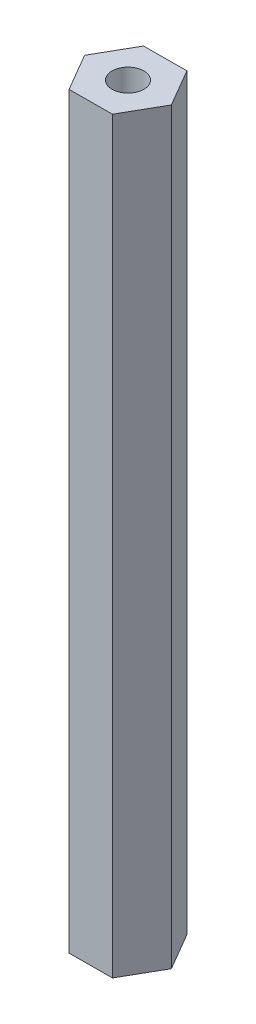
ISO-10303-21;
HEADER;
FILE_DESCRIPTION(('STEP AP214'),'2;1');
FILE_NAME('part.step','',(''),(''),'','','');
FILE_SCHEMA(('AUTOMOTIVE_DESIGN { 1 0 10303 214 1 1 1 1 }'));
ENDSEC;
DATA;
#1=APPLICATION_CONTEXT('core data for automotive mechanical design processes');
#2=APPLICATION_PROTOCOL_DEFINITION('international standard','automotive_design',2000,#1);
#3=PRODUCT_CONTEXT('',#1,'mechanical');
#4=PRODUCT('Part','Part','',(#3));
#5=PRODUCT_RELATED_PRODUCT_CATEGORY('part','',(#4));
#6=PRODUCT_DEFINITION_FORMATION('','',#4);
#7=PRODUCT_DEFINITION_CONTEXT('part definition',#1,'design');
#8=PRODUCT_DEFINITION('design','',#6,#7);
#9=PRODUCT_DEFINITION_SHAPE('','',#8);
#10=(LENGTH_UNIT() NAMED_UNIT(*) SI_UNIT(.MILLI.,.METRE.));
#11=(NAMED_UNIT(*) PLANE_ANGLE_UNIT() SI_UNIT($,.RADIAN.));
#12=(NAMED_UNIT(*) SI_UNIT($,.STERADIAN.) SOLID_ANGLE_UNIT());
#13=UNCERTAINTY_MEASURE_WITH_UNIT(LENGTH_MEASURE(1.E-05),#10,'distance_accuracy_value','');
#14=(GEOMETRIC_REPRESENTATION_CONTEXT(3) GLOBAL_UNCERTAINTY_ASSIGNED_CONTEXT((#13)) GLOBAL_UNIT_ASSIGNED_CONTEXT((#10,
#11,#12)) REPRESENTATION_CONTEXT('',''));
#15=CARTESIAN_POINT('',(0.,0.,0.));
#16=DIRECTION('',(0.,0.,1.));
#17=DIRECTION('',(1.,0.,0.));
#18=AXIS2_PLACEMENT_3D('',#15,#16,#17);
#19=CARTESIAN_POINT('',(1.81885853104389,63.5,-3.18317247056803));
#20=DIRECTION('',(0.00447565788556657,0.,0.999989984193087));
#21=DIRECTION('',(0.999989984193088,0.,-0.00447565788556657));
#22=AXIS2_PLACEMENT_3D('',#19,#20,#21);
#23=PLANE('',#22);
#24=DIRECTION('',(-0.999989984193087,0.,0.00447565788556657));
#25=VECTOR('',#24,1.);
#26=CARTESIAN_POINT('',(1.81885853104389,0.,-3.18317247056803));
#27=LINE('',#26,#25);
#28=CARTESIAN_POINT('',(1.81885853104389,0.,-3.18317247056803));
#29=VERTEX_POINT('',#28);
#30=CARTESIAN_POINT('',(-1.84727895861724,0.,-3.16676392905808));
#31=VERTEX_POINT('',#30);
#32=EDGE_CURVE('E117',#29,#31,#27,.T.);
#33=ORIENTED_EDGE('',*,*,#32,.T.);
#34=DIRECTION('',(0.,-1.,0.));
#35=VECTOR('',#34,1.);
#36=CARTESIAN_POINT('',(-1.84727895861724,63.5,-3.16676392905808));
#37=LINE('',#36,#35);
#38=CARTESIAN_POINT('',(-1.84727895861724,63.5,-3.16676392905808));
#39=VERTEX_POINT('',#38);
#40=EDGE_CURVE('E11',#39,#31,#37,.T.);
#41=ORIENTED_EDGE('',*,*,#40,.F.);
#42=DIRECTION('',(-0.999989984193087,0.,0.00447565788556657));
#43=VECTOR('',#42,1.);
#44=CARTESIAN_POINT('',(1.81885853104389,63.5,-3.18317247056803));
#45=LINE('',#44,#43);
#46=CARTESIAN_POINT('',(1.81885853104389,63.5,-3.18317247056803));
#47=VERTEX_POINT('',#46);
#48=EDGE_CURVE('E128',#47,#39,#45,.T.);
#49=ORIENTED_EDGE('',*,*,#48,.F.);
#50=DIRECTION('',(0.,-1.,0.));
#51=VECTOR('',#50,1.);
#52=CARTESIAN_POINT('',(1.81885853104389,63.5,-3.18317247056803));
#53=LINE('',#52,#51);
#54=EDGE_CURVE('E113',#47,#29,#53,.T.);
#55=ORIENTED_EDGE('',*,*,#54,.T.);
#56=EDGE_LOOP('',(#33,#41,#49,#55));
#57=FACE_BOUND('',#56,.T.);
#58=ADVANCED_FACE('F33',(#57),#23,.F.);
#59=CARTESIAN_POINT('',(-1.84727895861724,63.5,-3.16676392905808));
#60=DIRECTION('',(0.868254558783996,0.,0.496118958668995));
#61=DIRECTION('',(0.496118958668995,0.,-0.868254558783996));
#62=AXIS2_PLACEMENT_3D('',#59,#60,#61);
#63=PLANE('',#62);
#64=DIRECTION('',(-0.496118958668995,0.,0.868254558783996));
#65=VECTOR('',#64,1.);
#66=CARTESIAN_POINT('',(-1.84727895861724,0.,-3.16676392905808));
#67=LINE('',#66,#65);
#68=CARTESIAN_POINT('',(-3.66613748966113,0.,0.0164085415099574));
#69=VERTEX_POINT('',#68);
#70=EDGE_CURVE('E120',#31,#69,#67,.T.);
#71=ORIENTED_EDGE('',*,*,#70,.T.);
#72=DIRECTION('',(0.,-1.,0.));
#73=VECTOR('',#72,1.);
#74=CARTESIAN_POINT('',(-3.66613748966113,63.5,0.0164085415099574));
#75=LINE('',#74,#73);
#76=CARTESIAN_POINT('',(-3.66613748966113,63.5,0.0164085415099574));
#77=VERTEX_POINT('',#76);
#78=EDGE_CURVE('E41',#77,#69,#75,.T.);
#79=ORIENTED_EDGE('',*,*,#78,.F.);
#80=DIRECTION('',(-0.496118958668995,0.,0.868254558783996));
#81=VECTOR('',#80,1.);
#82=CARTESIAN_POINT('',(-1.84727895861724,63.5,-3.16676392905808));
#83=LINE('',#82,#81);
#84=EDGE_CURVE('E86',#39,#77,#83,.T.);
#85=ORIENTED_EDGE('',*,*,#84,.F.);
#86=ORIENTED_EDGE('',*,*,#40,.T.);
#87=EDGE_LOOP('',(#71,#79,#85,#86));
#88=FACE_BOUND('',#87,.T.);
#89=ADVANCED_FACE('F153',(#88),#63,.F.);
#90=CARTESIAN_POINT('',(-3.66613748966113,63.5,0.0164085415099574));
#91=DIRECTION('',(0.863778900898429,0.,-0.503871025524093));
#92=DIRECTION('',(-0.503871025524093,0.,-0.86377890089843));
#93=AXIS2_PLACEMENT_3D('',#90,#91,#92);
#94=PLANE('',#93);
#95=DIRECTION('',(0.503871025524093,0.,0.86377890089843));
#96=VECTOR('',#95,1.);
#97=CARTESIAN_POINT('',(-3.66613748966113,0.,0.0164085415099574));
#98=LINE('',#97,#96);
#99=CARTESIAN_POINT('',(-1.81885853104389,0.,3.18317247056804));
#100=VERTEX_POINT('',#99);
#101=EDGE_CURVE('E123',#69,#100,#98,.T.);
#102=ORIENTED_EDGE('',*,*,#101,.T.);
#103=DIRECTION('',(0.,-1.,0.));
#104=VECTOR('',#103,1.);
#105=CARTESIAN_POINT('',(-1.81885853104389,63.5,3.18317247056804));
#106=LINE('',#105,#104);
#107=CARTESIAN_POINT('',(-1.81885853104389,63.5,3.18317247056804));
#108=VERTEX_POINT('',#107);
#109=EDGE_CURVE('E108',#108,#100,#106,.T.);
#110=ORIENTED_EDGE('',*,*,#109,.F.);
#111=DIRECTION('',(0.503871025524093,0.,0.86377890089843));
#112=VECTOR('',#111,1.);
#113=CARTESIAN_POINT('',(-3.66613748966113,63.5,0.0164085415099574));
#114=LINE('',#113,#112);
#115=EDGE_CURVE('E99',#77,#108,#114,.T.);
#116=ORIENTED_EDGE('',*,*,#115,.F.);
#117=ORIENTED_EDGE('',*,*,#78,.T.);
#118=EDGE_LOOP('',(#102,#110,#116,#117));
#119=FACE_BOUND('',#118,.T.);
#120=ADVANCED_FACE('F134',(#119),#94,.F.);
#121=CARTESIAN_POINT('',(-1.81885853104389,63.5,3.18317247056804));
#122=DIRECTION('',(-0.00447565788556681,0.,-0.999989984193087));
#123=DIRECTION('',(-0.999989984193088,0.,0.00447565788556681));
#124=AXIS2_PLACEMENT_3D('',#121,#122,#123);
#125=PLANE('',#124);
#126=DIRECTION('',(0.999989984193087,0.,-0.00447565788556681));
#127=VECTOR('',#126,1.);
#128=CARTESIAN_POINT('',(-1.81885853104389,0.,3.18317247056804));
#129=LINE('',#128,#127);
#130=CARTESIAN_POINT('',(1.84727895861724,0.,3.16676392905808));
#131=VERTEX_POINT('',#130);
#132=EDGE_CURVE('E107',#100,#131,#129,.T.);
#133=ORIENTED_EDGE('',*,*,#132,.T.);
#134=DIRECTION('',(0.,-1.,0.));
#135=VECTOR('',#134,1.);
#136=CARTESIAN_POINT('',(1.84727895861724,63.5,3.16676392905808));
#137=LINE('',#136,#135);
#138=CARTESIAN_POINT('',(1.84727895861724,63.5,3.16676392905808));
#139=VERTEX_POINT('',#138);
#140=EDGE_CURVE('E104',#139,#131,#137,.T.);
#141=ORIENTED_EDGE('',*,*,#140,.F.);
#142=DIRECTION('',(0.999989984193087,0.,-0.00447565788556681));
#143=VECTOR('',#142,1.);
#144=CARTESIAN_POINT('',(-1.81885853104389,63.5,3.18317247056804));
#145=LINE('',#144,#143);
#146=EDGE_CURVE('E93',#108,#139,#145,.T.);
#147=ORIENTED_EDGE('',*,*,#146,.F.);
#148=ORIENTED_EDGE('',*,*,#109,.T.);
#149=EDGE_LOOP('',(#133,#141,#147,#148));
#150=FACE_BOUND('',#149,.T.);
#151=ADVANCED_FACE('F105',(#150),#125,.F.);
#152=CARTESIAN_POINT('',(1.84727895861724,63.5,3.16676392905808));
#153=DIRECTION('',(-0.868254558783996,0.,-0.496118958668995));
#154=DIRECTION('',(-0.496118958668995,0.,0.868254558783997));
#155=AXIS2_PLACEMENT_3D('',#152,#153,#154);
#156=PLANE('',#155);
#157=DIRECTION('',(0.496118958668995,0.,-0.868254558783996));
#158=VECTOR('',#157,1.);
#159=CARTESIAN_POINT('',(1.84727895861724,0.,3.16676392905808));
#160=LINE('',#159,#158);
#161=CARTESIAN_POINT('',(3.66613748966114,0.,-0.0164085415099599));
#162=VERTEX_POINT('',#161);
#163=EDGE_CURVE('E72',#131,#162,#160,.T.);
#164=ORIENTED_EDGE('',*,*,#163,.T.);
#165=DIRECTION('',(0.,-1.,0.));
#166=VECTOR('',#165,1.);
#167=CARTESIAN_POINT('',(3.66613748966114,63.5,-0.0164085415099599));
#168=LINE('',#167,#166);
#169=CARTESIAN_POINT('',(3.66613748966114,63.5,-0.0164085415099599));
#170=VERTEX_POINT('',#169);
#171=EDGE_CURVE('E109',#170,#162,#168,.T.);
#172=ORIENTED_EDGE('',*,*,#171,.F.);
#173=DIRECTION('',(0.496118958668995,0.,-0.868254558783996));
#174=VECTOR('',#173,1.);
#175=CARTESIAN_POINT('',(1.84727895861724,63.5,3.16676392905808));
#176=LINE('',#175,#174);
#177=EDGE_CURVE('E97',#139,#170,#176,.T.);
#178=ORIENTED_EDGE('',*,*,#177,.F.);
#179=ORIENTED_EDGE('',*,*,#140,.T.);
#180=EDGE_LOOP('',(#164,#172,#178,#179));
#181=FACE_BOUND('',#180,.T.);
#182=ADVANCED_FACE('F111',(#181),#156,.F.);
#183=CARTESIAN_POINT('',(3.66613748966114,63.5,-0.0164085415099599));
#184=DIRECTION('',(-0.86377890089843,0.,0.503871025524093));
#185=DIRECTION('',(0.503871025524093,0.,0.86377890089843));
#186=AXIS2_PLACEMENT_3D('',#183,#184,#185);
#187=PLANE('',#186);
#188=DIRECTION('',(-0.503871025524093,0.,-0.86377890089843));
#189=VECTOR('',#188,1.);
#190=CARTESIAN_POINT('',(3.66613748966114,0.,-0.0164085415099599));
#191=LINE('',#190,#189);
#192=EDGE_CURVE('E78',#162,#29,#191,.T.);
#193=ORIENTED_EDGE('',*,*,#192,.T.);
#194=ORIENTED_EDGE('',*,*,#54,.F.);
#195=DIRECTION('',(-0.503871025524093,0.,-0.86377890089843));
#196=VECTOR('',#195,1.);
#197=CARTESIAN_POINT('',(3.66613748966114,63.5,-0.0164085415099599));
#198=LINE('',#197,#196);
#199=EDGE_CURVE('E49',#170,#47,#198,.T.);
#200=ORIENTED_EDGE('',*,*,#199,.F.);
#201=ORIENTED_EDGE('',*,*,#171,.T.);
#202=EDGE_LOOP('',(#193,#194,#200,#201));
#203=FACE_BOUND('',#202,.T.);
#204=ADVANCED_FACE('F141',(#203),#187,.F.);
#205=CARTESIAN_POINT('',(0.,63.5,0.));
#206=DIRECTION('',(0.,1.,0.));
#207=DIRECTION('',(0.,0.,1.));
#208=AXIS2_PLACEMENT_3D('',#205,#206,#207);
#209=PLANE('',#208);
#210=CARTESIAN_POINT('',(0.,63.5,0.));
#211=DIRECTION('',(0.,1.,0.));
#212=DIRECTION('',(0.,0.,1.));
#213=AXIS2_PLACEMENT_3D('',#210,#211,#212);
#214=CIRCLE('',#213,1.35255);
#215=CARTESIAN_POINT('',(0.,63.5,1.35255));
#216=VERTEX_POINT('',#215);
#217=EDGE_CURVE('E208',#216,#216,#214,.T.);
#218=ORIENTED_EDGE('',*,*,#217,.F.);
#219=EDGE_LOOP('',(#218));
#220=FACE_BOUND('',#219,.T.);
#221=ORIENTED_EDGE('',*,*,#48,.T.);
#222=ORIENTED_EDGE('',*,*,#84,.T.);
#223=ORIENTED_EDGE('',*,*,#115,.T.);
#224=ORIENTED_EDGE('',*,*,#146,.T.);
#225=ORIENTED_EDGE('',*,*,#177,.T.);
#226=ORIENTED_EDGE('',*,*,#199,.T.);
#227=EDGE_LOOP('',(#221,#222,#223,#224,#225,#226));
#228=FACE_BOUND('',#227,.T.);
#229=ADVANCED_FACE('F95',(#220,#228),#209,.T.);
#230=CARTESIAN_POINT('',(0.,0.,0.));
#231=DIRECTION('',(0.,1.,0.));
#232=DIRECTION('',(0.,0.,1.));
#233=AXIS2_PLACEMENT_3D('',#230,#231,#232);
#234=PLANE('',#233);
#235=CARTESIAN_POINT('',(0.,0.,0.));
#236=DIRECTION('',(0.,1.,0.));
#237=DIRECTION('',(0.,0.,1.));
#238=AXIS2_PLACEMENT_3D('',#235,#236,#237);
#239=CIRCLE('',#238,1.35255);
#240=CARTESIAN_POINT('',(0.,0.,1.35255));
#241=VERTEX_POINT('',#240);
#242=EDGE_CURVE('E121',#241,#241,#239,.T.);
#243=ORIENTED_EDGE('',*,*,#242,.T.);
#244=EDGE_LOOP('',(#243));
#245=FACE_BOUND('',#244,.T.);
#246=ORIENTED_EDGE('',*,*,#32,.F.);
#247=ORIENTED_EDGE('',*,*,#192,.F.);
#248=ORIENTED_EDGE('',*,*,#163,.F.);
#249=ORIENTED_EDGE('',*,*,#132,.F.);
#250=ORIENTED_EDGE('',*,*,#101,.F.);
#251=ORIENTED_EDGE('',*,*,#70,.F.);
#252=EDGE_LOOP('',(#246,#247,#248,#249,#250,#251));
#253=FACE_BOUND('',#252,.T.);
#254=ADVANCED_FACE('F137',(#245,#253),#234,.F.);
#255=CARTESIAN_POINT('',(0.,0.,0.));
#256=DIRECTION('',(0.,1.,0.));
#257=DIRECTION('',(0.,0.,1.));
#258=AXIS2_PLACEMENT_3D('',#255,#256,#257);
#259=CYLINDRICAL_SURFACE('',#258,1.35255);
#260=ORIENTED_EDGE('',*,*,#242,.F.);
#261=EDGE_LOOP('',(#260));
#262=FACE_BOUND('',#261,.T.);
#263=ORIENTED_EDGE('',*,*,#217,.T.);
#264=EDGE_LOOP('',(#263));
#265=FACE_BOUND('',#264,.T.);
#266=ADVANCED_FACE('F190',(#262,#265),#259,.F.);
#267=CLOSED_SHELL('',(#58,#89,#120,#151,#182,#204,#229,#254,#266));
#268=MANIFOLD_SOLID_BREP('B2',#267);
#269=ADVANCED_BREP_SHAPE_REPRESENTATION('',(#18,#268),#14);
#270=SHAPE_DEFINITION_REPRESENTATION(#9,#269);
ENDSEC;
END-ISO-10303-21;
